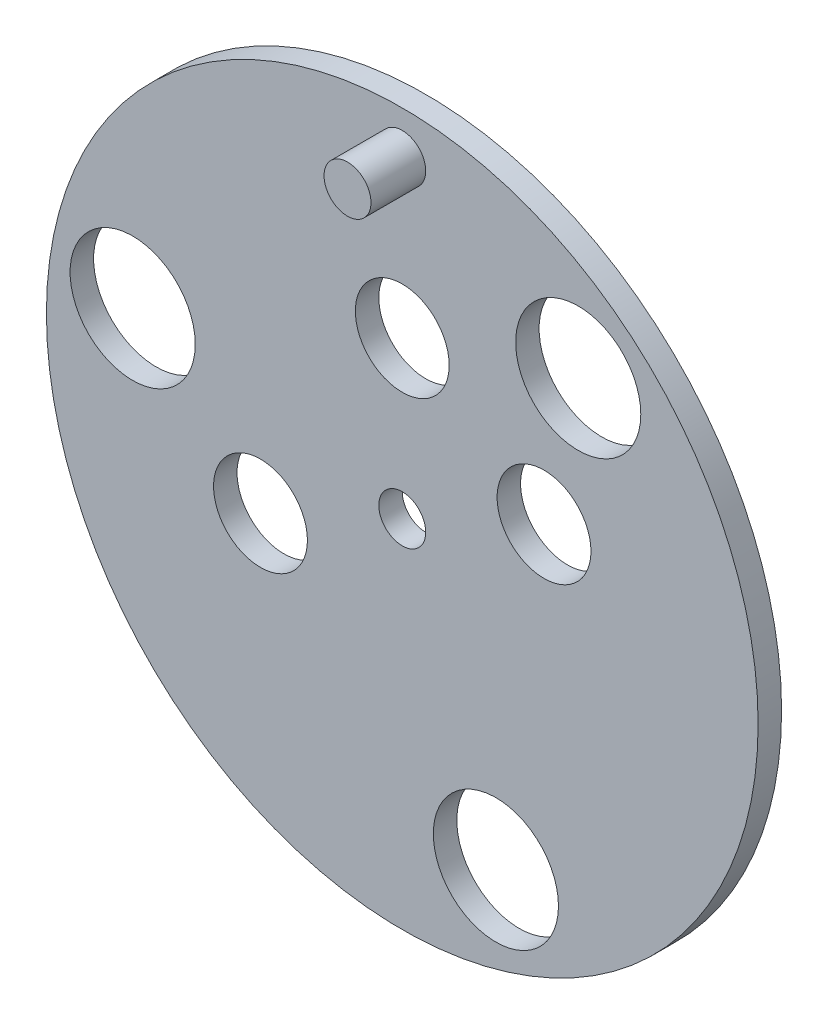
ISO-10303-21;
HEADER;
FILE_DESCRIPTION(('STEP AP214'),'2;1');
FILE_NAME('part.step','',(''),(''),'','','');
FILE_SCHEMA(('AUTOMOTIVE_DESIGN { 1 0 10303 214 1 1 1 1 }'));
ENDSEC;
DATA;
#1=APPLICATION_CONTEXT('core data for automotive mechanical design processes');
#2=APPLICATION_PROTOCOL_DEFINITION('international standard','automotive_design',2000,#1);
#3=PRODUCT_CONTEXT('',#1,'mechanical');
#4=PRODUCT('Part','Part','',(#3));
#5=PRODUCT_RELATED_PRODUCT_CATEGORY('part','',(#4));
#6=PRODUCT_DEFINITION_FORMATION('','',#4);
#7=PRODUCT_DEFINITION_CONTEXT('part definition',#1,'design');
#8=PRODUCT_DEFINITION('design','',#6,#7);
#9=PRODUCT_DEFINITION_SHAPE('','',#8);
#10=(LENGTH_UNIT() NAMED_UNIT(*) SI_UNIT(.MILLI.,.METRE.));
#11=(NAMED_UNIT(*) PLANE_ANGLE_UNIT() SI_UNIT($,.RADIAN.));
#12=(NAMED_UNIT(*) SI_UNIT($,.STERADIAN.) SOLID_ANGLE_UNIT());
#13=UNCERTAINTY_MEASURE_WITH_UNIT(LENGTH_MEASURE(1.E-05),#10,'distance_accuracy_value','');
#14=(GEOMETRIC_REPRESENTATION_CONTEXT(3) GLOBAL_UNCERTAINTY_ASSIGNED_CONTEXT((#13)) GLOBAL_UNIT_ASSIGNED_CONTEXT((#10,
#11,#12)) REPRESENTATION_CONTEXT('',''));
#15=CARTESIAN_POINT('',(0.,0.,0.));
#16=DIRECTION('',(0.,0.,1.));
#17=DIRECTION('',(1.,0.,0.));
#18=AXIS2_PLACEMENT_3D('',#15,#16,#17);
#19=CARTESIAN_POINT('',(0.,0.,7.5));
#20=DIRECTION('',(0.,0.,-1.));
#21=DIRECTION('',(-1.,0.,0.));
#22=AXIS2_PLACEMENT_3D('',#19,#20,#21);
#23=CYLINDRICAL_SURFACE('',#22,227.5);
#24=CARTESIAN_POINT('',(0.,0.,7.5));
#25=DIRECTION('',(0.,0.,1.));
#26=DIRECTION('',(1.,0.,0.));
#27=AXIS2_PLACEMENT_3D('',#24,#25,#26);
#28=CIRCLE('',#27,227.5);
#29=CARTESIAN_POINT('',(227.5,0.,7.5));
#30=VERTEX_POINT('',#29);
#31=EDGE_CURVE('E10',#30,#30,#28,.T.);
#32=ORIENTED_EDGE('',*,*,#31,.F.);
#33=EDGE_LOOP('',(#32));
#34=FACE_BOUND('',#33,.T.);
#35=CARTESIAN_POINT('',(0.,0.,-7.5));
#36=DIRECTION('',(0.,0.,1.));
#37=DIRECTION('',(1.,0.,0.));
#38=AXIS2_PLACEMENT_3D('',#35,#36,#37);
#39=CIRCLE('',#38,227.5);
#40=CARTESIAN_POINT('',(227.5,0.,-7.5));
#41=VERTEX_POINT('',#40);
#42=EDGE_CURVE('E36',#41,#41,#39,.T.);
#43=ORIENTED_EDGE('',*,*,#42,.T.);
#44=EDGE_LOOP('',(#43));
#45=FACE_BOUND('',#44,.T.);
#46=ADVANCED_FACE('F33',(#34,#45),#23,.T.);
#47=CARTESIAN_POINT('',(0.,0.,7.5));
#48=DIRECTION('',(0.,0.,1.));
#49=DIRECTION('',(1.,0.,0.));
#50=AXIS2_PLACEMENT_3D('',#47,#48,#49);
#51=PLANE('',#50);
#52=CARTESIAN_POINT('',(0.,0.,7.5));
#53=DIRECTION('',(0.,0.,1.));
#54=DIRECTION('',(1.,0.,0.));
#55=AXIS2_PLACEMENT_3D('',#52,#53,#54);
#56=CIRCLE('',#55,15.);
#57=CARTESIAN_POINT('',(15.,0.,7.5));
#58=VERTEX_POINT('',#57);
#59=EDGE_CURVE('E89',#58,#58,#56,.T.);
#60=ORIENTED_EDGE('',*,*,#59,.F.);
#61=EDGE_LOOP('',(#60));
#62=FACE_BOUND('',#61,.T.);
#63=CARTESIAN_POINT('',(-172.341356777136,30.3884310917135,7.5));
#64=DIRECTION('',(0.,0.,1.));
#65=DIRECTION('',(1.,0.,0.));
#66=AXIS2_PLACEMENT_3D('',#63,#64,#65);
#67=CIRCLE('',#66,40.);
#68=CARTESIAN_POINT('',(-132.341356777136,30.3884310917135,7.5));
#69=VERTEX_POINT('',#68);
#70=EDGE_CURVE('E82',#69,#69,#67,.T.);
#71=ORIENTED_EDGE('',*,*,#70,.F.);
#72=EDGE_LOOP('',(#71));
#73=FACE_BOUND('',#72,.T.);
#74=CARTESIAN_POINT('',(0.,100.,7.5));
#75=DIRECTION('',(0.,0.,1.));
#76=DIRECTION('',(1.,0.,0.));
#77=AXIS2_PLACEMENT_3D('',#74,#75,#76);
#78=CIRCLE('',#77,30.);
#79=CARTESIAN_POINT('',(30.,100.,7.5));
#80=VERTEX_POINT('',#79);
#81=EDGE_CURVE('E76',#80,#80,#78,.T.);
#82=ORIENTED_EDGE('',*,*,#81,.F.);
#83=EDGE_LOOP('',(#82));
#84=FACE_BOUND('',#83,.T.);
#85=CARTESIAN_POINT('',(-90.6307787036648,-42.2618261740704,7.5));
#86=DIRECTION('',(0.,0.,1.));
#87=DIRECTION('',(1.,0.,0.));
#88=AXIS2_PLACEMENT_3D('',#85,#86,#87);
#89=CIRCLE('',#88,30.);
#90=CARTESIAN_POINT('',(-60.6307787036648,-42.2618261740704,7.5));
#91=VERTEX_POINT('',#90);
#92=EDGE_CURVE('E70',#91,#91,#89,.T.);
#93=ORIENTED_EDGE('',*,*,#92,.F.);
#94=EDGE_LOOP('',(#93));
#95=FACE_BOUND('',#94,.T.);
#96=CARTESIAN_POINT('',(90.6307787036648,42.2618261740704,7.5));
#97=DIRECTION('',(0.,0.,1.));
#98=DIRECTION('',(1.,0.,0.));
#99=AXIS2_PLACEMENT_3D('',#96,#97,#98);
#100=CIRCLE('',#99,29.9999999999999);
#101=CARTESIAN_POINT('',(120.630778703665,42.2618261740704,7.5));
#102=VERTEX_POINT('',#101);
#103=EDGE_CURVE('E64',#102,#102,#100,.T.);
#104=ORIENTED_EDGE('',*,*,#103,.F.);
#105=EDGE_LOOP('',(#104));
#106=FACE_BOUND('',#105,.T.);
#107=CARTESIAN_POINT('',(112.487831695139,134.057777545837,7.5));
#108=DIRECTION('',(0.,0.,1.));
#109=DIRECTION('',(1.,0.,0.));
#110=AXIS2_PLACEMENT_3D('',#107,#108,#109);
#111=CIRCLE('',#110,40.0000000000148);
#112=CARTESIAN_POINT('',(152.487831695154,134.057777545837,7.5));
#113=VERTEX_POINT('',#112);
#114=EDGE_CURVE('E58',#113,#113,#111,.T.);
#115=ORIENTED_EDGE('',*,*,#114,.F.);
#116=EDGE_LOOP('',(#115));
#117=FACE_BOUND('',#116,.T.);
#118=CARTESIAN_POINT('',(59.8535250820026,-164.446208637521,7.5));
#119=DIRECTION('',(0.,0.,1.));
#120=DIRECTION('',(1.,0.,0.));
#121=AXIS2_PLACEMENT_3D('',#118,#119,#120);
#122=CIRCLE('',#121,40.);
#123=CARTESIAN_POINT('',(99.8535250820026,-164.446208637521,7.5));
#124=VERTEX_POINT('',#123);
#125=EDGE_CURVE('E51',#124,#124,#122,.T.);
#126=ORIENTED_EDGE('',*,*,#125,.F.);
#127=EDGE_LOOP('',(#126));
#128=FACE_BOUND('',#127,.T.);
#129=CARTESIAN_POINT('',(0.,200.,7.5));
#130=DIRECTION('',(0.,0.,1.));
#131=DIRECTION('',(1.,0.,0.));
#132=AXIS2_PLACEMENT_3D('',#129,#130,#131);
#133=CIRCLE('',#132,15.);
#134=CARTESIAN_POINT('',(15.,200.,7.5));
#135=VERTEX_POINT('',#134);
#136=EDGE_CURVE('E47',#135,#135,#133,.T.);
#137=ORIENTED_EDGE('',*,*,#136,.F.);
#138=EDGE_LOOP('',(#137));
#139=FACE_BOUND('',#138,.T.);
#140=ORIENTED_EDGE('',*,*,#31,.T.);
#141=EDGE_LOOP('',(#140));
#142=FACE_BOUND('',#141,.T.);
#143=ADVANCED_FACE('F95',(#62,#73,#84,#95,#106,#117,#128,#139,#142),#51,.T.);
#144=CARTESIAN_POINT('',(0.,0.,-7.5));
#145=DIRECTION('',(0.,0.,1.));
#146=DIRECTION('',(1.,0.,0.));
#147=AXIS2_PLACEMENT_3D('',#144,#145,#146);
#148=PLANE('',#147);
#149=CARTESIAN_POINT('',(0.,0.,-7.5));
#150=DIRECTION('',(0.,0.,1.));
#151=DIRECTION('',(1.,0.,0.));
#152=AXIS2_PLACEMENT_3D('',#149,#150,#151);
#153=CIRCLE('',#152,15.);
#154=CARTESIAN_POINT('',(15.,0.,-7.5));
#155=VERTEX_POINT('',#154);
#156=EDGE_CURVE('E55',#155,#155,#153,.F.);
#157=ORIENTED_EDGE('',*,*,#156,.F.);
#158=EDGE_LOOP('',(#157));
#159=FACE_BOUND('',#158,.T.);
#160=CARTESIAN_POINT('',(-172.341356777136,30.3884310917135,-7.5));
#161=DIRECTION('',(0.,0.,1.));
#162=DIRECTION('',(1.,0.,0.));
#163=AXIS2_PLACEMENT_3D('',#160,#161,#162);
#164=CIRCLE('',#163,40.);
#165=CARTESIAN_POINT('',(-132.341356777136,30.3884310917135,-7.5));
#166=VERTEX_POINT('',#165);
#167=EDGE_CURVE('E50',#166,#166,#164,.T.);
#168=ORIENTED_EDGE('',*,*,#167,.T.);
#169=EDGE_LOOP('',(#168));
#170=FACE_BOUND('',#169,.T.);
#171=CARTESIAN_POINT('',(0.,100.,-7.5));
#172=DIRECTION('',(0.,0.,1.));
#173=DIRECTION('',(1.,0.,0.));
#174=AXIS2_PLACEMENT_3D('',#171,#172,#173);
#175=CIRCLE('',#174,30.);
#176=CARTESIAN_POINT('',(30.,100.,-7.5));
#177=VERTEX_POINT('',#176);
#178=EDGE_CURVE('E79',#177,#177,#175,.T.);
#179=ORIENTED_EDGE('',*,*,#178,.T.);
#180=EDGE_LOOP('',(#179));
#181=FACE_BOUND('',#180,.T.);
#182=CARTESIAN_POINT('',(-90.6307787036648,-42.2618261740704,-7.5));
#183=DIRECTION('',(0.,0.,1.));
#184=DIRECTION('',(1.,0.,0.));
#185=AXIS2_PLACEMENT_3D('',#182,#183,#184);
#186=CIRCLE('',#185,30.);
#187=CARTESIAN_POINT('',(-60.6307787036648,-42.2618261740704,-7.5));
#188=VERTEX_POINT('',#187);
#189=EDGE_CURVE('E73',#188,#188,#186,.T.);
#190=ORIENTED_EDGE('',*,*,#189,.T.);
#191=EDGE_LOOP('',(#190));
#192=FACE_BOUND('',#191,.T.);
#193=CARTESIAN_POINT('',(90.6307787036648,42.2618261740704,-7.5));
#194=DIRECTION('',(0.,0.,1.));
#195=DIRECTION('',(1.,0.,0.));
#196=AXIS2_PLACEMENT_3D('',#193,#194,#195);
#197=CIRCLE('',#196,29.9999999999999);
#198=CARTESIAN_POINT('',(120.630778703665,42.2618261740704,-7.5));
#199=VERTEX_POINT('',#198);
#200=EDGE_CURVE('E67',#199,#199,#197,.T.);
#201=ORIENTED_EDGE('',*,*,#200,.T.);
#202=EDGE_LOOP('',(#201));
#203=FACE_BOUND('',#202,.T.);
#204=CARTESIAN_POINT('',(112.487831695139,134.057777545837,-7.5));
#205=DIRECTION('',(0.,0.,1.));
#206=DIRECTION('',(1.,0.,0.));
#207=AXIS2_PLACEMENT_3D('',#204,#205,#206);
#208=CIRCLE('',#207,40.0000000000148);
#209=CARTESIAN_POINT('',(152.487831695154,134.057777545837,-7.5));
#210=VERTEX_POINT('',#209);
#211=EDGE_CURVE('E61',#210,#210,#208,.T.);
#212=ORIENTED_EDGE('',*,*,#211,.T.);
#213=EDGE_LOOP('',(#212));
#214=FACE_BOUND('',#213,.T.);
#215=CARTESIAN_POINT('',(59.8535250820026,-164.446208637521,-7.5));
#216=DIRECTION('',(0.,0.,1.));
#217=DIRECTION('',(1.,0.,0.));
#218=AXIS2_PLACEMENT_3D('',#215,#216,#217);
#219=CIRCLE('',#218,40.);
#220=CARTESIAN_POINT('',(99.8535250820026,-164.446208637521,-7.5));
#221=VERTEX_POINT('',#220);
#222=EDGE_CURVE('E54',#221,#221,#219,.T.);
#223=ORIENTED_EDGE('',*,*,#222,.T.);
#224=EDGE_LOOP('',(#223));
#225=FACE_BOUND('',#224,.T.);
#226=ORIENTED_EDGE('',*,*,#42,.F.);
#227=EDGE_LOOP('',(#226));
#228=FACE_BOUND('',#227,.T.);
#229=ADVANCED_FACE('F98',(#159,#170,#181,#192,#203,#214,#225,#228),#148,.F.);
#230=CARTESIAN_POINT('',(0.,200.,84.926406871193));
#231=DIRECTION('',(0.,0.,-1.));
#232=DIRECTION('',(-1.,0.,0.));
#233=AXIS2_PLACEMENT_3D('',#230,#231,#232);
#234=CYLINDRICAL_SURFACE('',#233,15.);
#235=ORIENTED_EDGE('',*,*,#136,.T.);
#236=EDGE_LOOP('',(#235));
#237=FACE_BOUND('',#236,.T.);
#238=CARTESIAN_POINT('',(0.,200.,42.5000000000001));
#239=DIRECTION('',(0.,0.,1.));
#240=DIRECTION('',(1.,0.,0.));
#241=AXIS2_PLACEMENT_3D('',#238,#239,#240);
#242=CIRCLE('',#241,15.);
#243=CARTESIAN_POINT('',(15.,200.,42.5000000000002));
#244=VERTEX_POINT('',#243);
#245=EDGE_CURVE('E43',#244,#244,#242,.T.);
#246=ORIENTED_EDGE('',*,*,#245,.F.);
#247=EDGE_LOOP('',(#246));
#248=FACE_BOUND('',#247,.T.);
#249=ADVANCED_FACE('F114',(#237,#248),#234,.T.);
#250=CARTESIAN_POINT('',(95.6381200073658,360.015810235705,42.5000000000004));
#251=DIRECTION('',(0.,0.,1.));
#252=DIRECTION('',(-0.513030214988877,-0.858370548486181,0.));
#253=AXIS2_PLACEMENT_3D('',#250,#251,#252);
#254=PLANE('',#253);
#255=ORIENTED_EDGE('',*,*,#245,.T.);
#256=EDGE_LOOP('',(#255));
#257=FACE_BOUND('',#256,.T.);
#258=ADVANCED_FACE('F117',(#257),#254,.T.);
#259=CARTESIAN_POINT('',(59.8535250820026,-164.446208637521,-7.5));
#260=DIRECTION('',(0.,0.,1.));
#261=DIRECTION('',(1.,0.,0.));
#262=AXIS2_PLACEMENT_3D('',#259,#260,#261);
#263=CYLINDRICAL_SURFACE('',#262,40.);
#264=ORIENTED_EDGE('',*,*,#222,.F.);
#265=EDGE_LOOP('',(#264));
#266=FACE_BOUND('',#265,.T.);
#267=ORIENTED_EDGE('',*,*,#125,.T.);
#268=EDGE_LOOP('',(#267));
#269=FACE_BOUND('',#268,.T.);
#270=ADVANCED_FACE('F122',(#266,#269),#263,.F.);
#271=CARTESIAN_POINT('',(112.487831695139,134.057777545837,-7.5));
#272=DIRECTION('',(0.,0.,1.));
#273=DIRECTION('',(1.,0.,0.));
#274=AXIS2_PLACEMENT_3D('',#271,#272,#273);
#275=CYLINDRICAL_SURFACE('',#274,40.0000000000148);
#276=ORIENTED_EDGE('',*,*,#211,.F.);
#277=EDGE_LOOP('',(#276));
#278=FACE_BOUND('',#277,.T.);
#279=ORIENTED_EDGE('',*,*,#114,.T.);
#280=EDGE_LOOP('',(#279));
#281=FACE_BOUND('',#280,.T.);
#282=ADVANCED_FACE('F127',(#278,#281),#275,.F.);
#283=CARTESIAN_POINT('',(90.6307787036648,42.2618261740704,-7.5));
#284=DIRECTION('',(0.,0.,1.));
#285=DIRECTION('',(1.,0.,0.));
#286=AXIS2_PLACEMENT_3D('',#283,#284,#285);
#287=CYLINDRICAL_SURFACE('',#286,29.9999999999999);
#288=ORIENTED_EDGE('',*,*,#200,.F.);
#289=EDGE_LOOP('',(#288));
#290=FACE_BOUND('',#289,.T.);
#291=ORIENTED_EDGE('',*,*,#103,.T.);
#292=EDGE_LOOP('',(#291));
#293=FACE_BOUND('',#292,.T.);
#294=ADVANCED_FACE('F158',(#290,#293),#287,.F.);
#295=CARTESIAN_POINT('',(-90.6307787036648,-42.2618261740704,-7.5));
#296=DIRECTION('',(0.,0.,1.));
#297=DIRECTION('',(1.,0.,0.));
#298=AXIS2_PLACEMENT_3D('',#295,#296,#297);
#299=CYLINDRICAL_SURFACE('',#298,30.);
#300=ORIENTED_EDGE('',*,*,#189,.F.);
#301=EDGE_LOOP('',(#300));
#302=FACE_BOUND('',#301,.T.);
#303=ORIENTED_EDGE('',*,*,#92,.T.);
#304=EDGE_LOOP('',(#303));
#305=FACE_BOUND('',#304,.T.);
#306=ADVANCED_FACE('F163',(#302,#305),#299,.F.);
#307=CARTESIAN_POINT('',(0.,100.,-7.5));
#308=DIRECTION('',(0.,0.,1.));
#309=DIRECTION('',(1.,0.,0.));
#310=AXIS2_PLACEMENT_3D('',#307,#308,#309);
#311=CYLINDRICAL_SURFACE('',#310,30.);
#312=ORIENTED_EDGE('',*,*,#178,.F.);
#313=EDGE_LOOP('',(#312));
#314=FACE_BOUND('',#313,.T.);
#315=ORIENTED_EDGE('',*,*,#81,.T.);
#316=EDGE_LOOP('',(#315));
#317=FACE_BOUND('',#316,.T.);
#318=ADVANCED_FACE('F169',(#314,#317),#311,.F.);
#319=CARTESIAN_POINT('',(-172.341356777136,30.3884310917135,-7.5));
#320=DIRECTION('',(0.,0.,1.));
#321=DIRECTION('',(1.,0.,0.));
#322=AXIS2_PLACEMENT_3D('',#319,#320,#321);
#323=CYLINDRICAL_SURFACE('',#322,40.);
#324=ORIENTED_EDGE('',*,*,#167,.F.);
#325=EDGE_LOOP('',(#324));
#326=FACE_BOUND('',#325,.T.);
#327=ORIENTED_EDGE('',*,*,#70,.T.);
#328=EDGE_LOOP('',(#327));
#329=FACE_BOUND('',#328,.T.);
#330=ADVANCED_FACE('F173',(#326,#329),#323,.F.);
#331=CARTESIAN_POINT('',(0.,0.,-49.9264068711929));
#332=DIRECTION('',(0.,0.,1.));
#333=DIRECTION('',(1.,0.,0.));
#334=AXIS2_PLACEMENT_3D('',#331,#332,#333);
#335=CYLINDRICAL_SURFACE('',#334,15.);
#336=ORIENTED_EDGE('',*,*,#156,.T.);
#337=EDGE_LOOP('',(#336));
#338=FACE_BOUND('',#337,.T.);
#339=ORIENTED_EDGE('',*,*,#59,.T.);
#340=EDGE_LOOP('',(#339));
#341=FACE_BOUND('',#340,.T.);
#342=ADVANCED_FACE('F93',(#338,#341),#335,.F.);
#343=CLOSED_SHELL('',(#46,#143,#229,#249,#258,#270,#282,#294,#306,#318,#330,#342));
#344=MANIFOLD_SOLID_BREP('B2',#343);
#345=ADVANCED_BREP_SHAPE_REPRESENTATION('',(#18,#344),#14);
#346=SHAPE_DEFINITION_REPRESENTATION(#9,#345);
ENDSEC;
END-ISO-10303-21;
